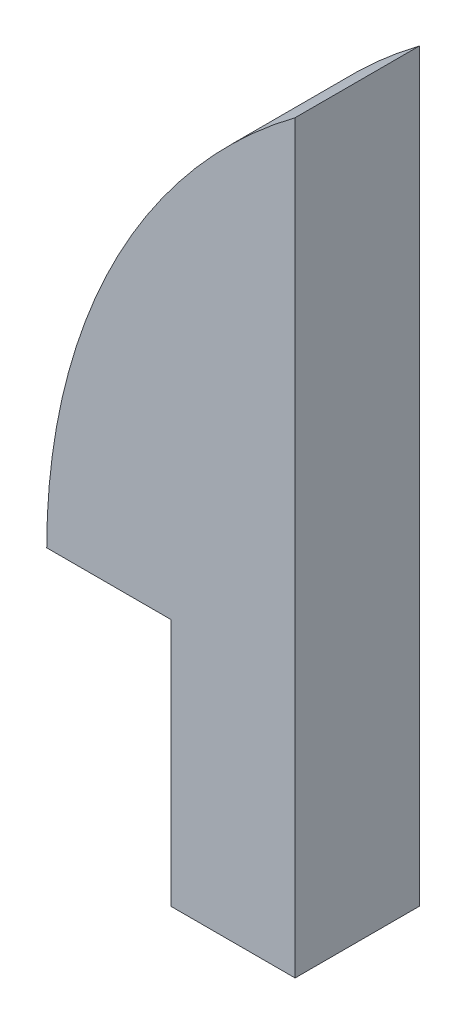
ISO-10303-21;
HEADER;
FILE_DESCRIPTION(('STEP AP214'),'2;1');
FILE_NAME('part.step','',(''),(''),'','','');
FILE_SCHEMA(('AUTOMOTIVE_DESIGN { 1 0 10303 214 1 1 1 1 }'));
ENDSEC;
DATA;
#1=APPLICATION_CONTEXT('core data for automotive mechanical design processes');
#2=APPLICATION_PROTOCOL_DEFINITION('international standard','automotive_design',2000,#1);
#3=PRODUCT_CONTEXT('',#1,'mechanical');
#4=PRODUCT('Part','Part','',(#3));
#5=PRODUCT_RELATED_PRODUCT_CATEGORY('part','',(#4));
#6=PRODUCT_DEFINITION_FORMATION('','',#4);
#7=PRODUCT_DEFINITION_CONTEXT('part definition',#1,'design');
#8=PRODUCT_DEFINITION('design','',#6,#7);
#9=PRODUCT_DEFINITION_SHAPE('','',#8);
#10=(LENGTH_UNIT() NAMED_UNIT(*) SI_UNIT(.MILLI.,.METRE.));
#11=(NAMED_UNIT(*) PLANE_ANGLE_UNIT() SI_UNIT($,.RADIAN.));
#12=(NAMED_UNIT(*) SI_UNIT($,.STERADIAN.) SOLID_ANGLE_UNIT());
#13=UNCERTAINTY_MEASURE_WITH_UNIT(LENGTH_MEASURE(1.E-05),#10,'distance_accuracy_value','');
#14=(GEOMETRIC_REPRESENTATION_CONTEXT(3) GLOBAL_UNCERTAINTY_ASSIGNED_CONTEXT((#13)) GLOBAL_UNIT_ASSIGNED_CONTEXT((#10,
#11,#12)) REPRESENTATION_CONTEXT('',''));
#15=CARTESIAN_POINT('',(0.,0.,0.));
#16=DIRECTION('',(0.,0.,1.));
#17=DIRECTION('',(1.,0.,0.));
#18=AXIS2_PLACEMENT_3D('',#15,#16,#17);
#19=CARTESIAN_POINT('',(31.75,12.7,6.35));
#20=DIRECTION('',(0.,0.,-1.));
#21=DIRECTION('',(-1.,0.,0.));
#22=AXIS2_PLACEMENT_3D('',#19,#20,#21);
#23=CYLINDRICAL_SURFACE('',#22,31.75);
#24=CARTESIAN_POINT('',(31.75,12.7,0.));
#25=DIRECTION('',(0.,0.,1.));
#26=DIRECTION('',(1.,0.,0.));
#27=AXIS2_PLACEMENT_3D('',#24,#25,#26);
#28=CIRCLE('',#27,31.75);
#29=CARTESIAN_POINT('',(0.,12.7,0.));
#30=VERTEX_POINT('',#29);
#31=CARTESIAN_POINT('',(12.7,38.1,0.));
#32=VERTEX_POINT('',#31);
#33=EDGE_CURVE('E108',#30,#32,#28,.F.);
#34=ORIENTED_EDGE('',*,*,#33,.F.);
#35=DIRECTION('',(0.,0.,-1.));
#36=VECTOR('',#35,1.);
#37=CARTESIAN_POINT('',(0.,12.7,6.35));
#38=LINE('',#37,#36);
#39=CARTESIAN_POINT('',(0.,12.7,6.35));
#40=VERTEX_POINT('',#39);
#41=EDGE_CURVE('E11',#40,#30,#38,.T.);
#42=ORIENTED_EDGE('',*,*,#41,.F.);
#43=CARTESIAN_POINT('',(31.75,12.7,6.35));
#44=DIRECTION('',(0.,0.,1.));
#45=DIRECTION('',(1.,0.,0.));
#46=AXIS2_PLACEMENT_3D('',#43,#44,#45);
#47=CIRCLE('',#46,31.75);
#48=CARTESIAN_POINT('',(12.7,38.1,6.35));
#49=VERTEX_POINT('',#48);
#50=EDGE_CURVE('E117',#40,#49,#47,.F.);
#51=ORIENTED_EDGE('',*,*,#50,.T.);
#52=DIRECTION('',(0.,0.,-1.));
#53=VECTOR('',#52,1.);
#54=CARTESIAN_POINT('',(12.7,38.1,6.35));
#55=LINE('',#54,#53);
#56=EDGE_CURVE('E77',#49,#32,#55,.T.);
#57=ORIENTED_EDGE('',*,*,#56,.T.);
#58=EDGE_LOOP('',(#34,#42,#51,#57));
#59=FACE_BOUND('',#58,.T.);
#60=ADVANCED_FACE('F35',(#59),#23,.T.);
#61=CARTESIAN_POINT('',(0.,12.7,6.35));
#62=DIRECTION('',(0.,1.,0.));
#63=DIRECTION('',(-1.,0.,0.));
#64=AXIS2_PLACEMENT_3D('',#61,#62,#63);
#65=PLANE('',#64);
#66=DIRECTION('',(1.,0.,0.));
#67=VECTOR('',#66,1.);
#68=CARTESIAN_POINT('',(0.,12.7,0.));
#69=LINE('',#68,#67);
#70=CARTESIAN_POINT('',(6.35,12.7,0.));
#71=VERTEX_POINT('',#70);
#72=EDGE_CURVE('E111',#30,#71,#69,.T.);
#73=ORIENTED_EDGE('',*,*,#72,.T.);
#74=DIRECTION('',(0.,0.,-1.));
#75=VECTOR('',#74,1.);
#76=CARTESIAN_POINT('',(6.35,12.7,6.35));
#77=LINE('',#76,#75);
#78=CARTESIAN_POINT('',(6.35,12.7,6.35));
#79=VERTEX_POINT('',#78);
#80=EDGE_CURVE('E43',#79,#71,#77,.T.);
#81=ORIENTED_EDGE('',*,*,#80,.F.);
#82=DIRECTION('',(1.,0.,0.));
#83=VECTOR('',#82,1.);
#84=CARTESIAN_POINT('',(0.,12.7,6.35));
#85=LINE('',#84,#83);
#86=EDGE_CURVE('E92',#40,#79,#85,.T.);
#87=ORIENTED_EDGE('',*,*,#86,.F.);
#88=ORIENTED_EDGE('',*,*,#41,.T.);
#89=EDGE_LOOP('',(#73,#81,#87,#88));
#90=FACE_BOUND('',#89,.T.);
#91=ADVANCED_FACE('F128',(#90),#65,.F.);
#92=CARTESIAN_POINT('',(6.35,0.,6.35));
#93=DIRECTION('',(1.,0.,0.));
#94=DIRECTION('',(0.,0.,-1.));
#95=AXIS2_PLACEMENT_3D('',#92,#93,#94);
#96=PLANE('',#95);
#97=DIRECTION('',(0.,-1.,0.));
#98=VECTOR('',#97,1.);
#99=CARTESIAN_POINT('',(6.35,0.,0.));
#100=LINE('',#99,#98);
#101=CARTESIAN_POINT('',(6.35,0.,0.));
#102=VERTEX_POINT('',#101);
#103=EDGE_CURVE('E100',#71,#102,#100,.T.);
#104=ORIENTED_EDGE('',*,*,#103,.T.);
#105=DIRECTION('',(0.,0.,-1.));
#106=VECTOR('',#105,1.);
#107=CARTESIAN_POINT('',(6.35,0.,6.35));
#108=LINE('',#107,#106);
#109=CARTESIAN_POINT('',(6.35,0.,6.35));
#110=VERTEX_POINT('',#109);
#111=EDGE_CURVE('E97',#110,#102,#108,.T.);
#112=ORIENTED_EDGE('',*,*,#111,.F.);
#113=DIRECTION('',(0.,-1.,0.));
#114=VECTOR('',#113,1.);
#115=CARTESIAN_POINT('',(6.35,0.,6.35));
#116=LINE('',#115,#114);
#117=EDGE_CURVE('E87',#79,#110,#116,.T.);
#118=ORIENTED_EDGE('',*,*,#117,.F.);
#119=ORIENTED_EDGE('',*,*,#80,.T.);
#120=EDGE_LOOP('',(#104,#112,#118,#119));
#121=FACE_BOUND('',#120,.T.);
#122=ADVANCED_FACE('F98',(#121),#96,.F.);
#123=CARTESIAN_POINT('',(0.,0.,6.35));
#124=DIRECTION('',(0.,1.,0.));
#125=DIRECTION('',(0.,0.,1.));
#126=AXIS2_PLACEMENT_3D('',#123,#124,#125);
#127=PLANE('',#126);
#128=DIRECTION('',(1.,0.,0.));
#129=VECTOR('',#128,1.);
#130=CARTESIAN_POINT('',(0.,0.,0.));
#131=LINE('',#130,#129);
#132=CARTESIAN_POINT('',(12.7,0.,0.));
#133=VERTEX_POINT('',#132);
#134=EDGE_CURVE('E70',#102,#133,#131,.T.);
#135=ORIENTED_EDGE('',*,*,#134,.T.);
#136=DIRECTION('',(0.,0.,-1.));
#137=VECTOR('',#136,1.);
#138=CARTESIAN_POINT('',(12.7,0.,6.35));
#139=LINE('',#138,#137);
#140=CARTESIAN_POINT('',(12.7,0.,6.35));
#141=VERTEX_POINT('',#140);
#142=EDGE_CURVE('E101',#141,#133,#139,.T.);
#143=ORIENTED_EDGE('',*,*,#142,.F.);
#144=DIRECTION('',(1.,0.,0.));
#145=VECTOR('',#144,1.);
#146=CARTESIAN_POINT('',(0.,0.,6.35));
#147=LINE('',#146,#145);
#148=EDGE_CURVE('E91',#110,#141,#147,.T.);
#149=ORIENTED_EDGE('',*,*,#148,.F.);
#150=ORIENTED_EDGE('',*,*,#111,.T.);
#151=EDGE_LOOP('',(#135,#143,#149,#150));
#152=FACE_BOUND('',#151,.T.);
#153=ADVANCED_FACE('F103',(#152),#127,.F.);
#154=CARTESIAN_POINT('',(12.7,0.,6.35));
#155=DIRECTION('',(-1.,0.,0.));
#156=DIRECTION('',(0.,0.,1.));
#157=AXIS2_PLACEMENT_3D('',#154,#155,#156);
#158=PLANE('',#157);
#159=DIRECTION('',(0.,1.,0.));
#160=VECTOR('',#159,1.);
#161=CARTESIAN_POINT('',(12.7,0.,0.));
#162=LINE('',#161,#160);
#163=EDGE_CURVE('E115',#133,#32,#162,.T.);
#164=ORIENTED_EDGE('',*,*,#163,.T.);
#165=ORIENTED_EDGE('',*,*,#56,.F.);
#166=DIRECTION('',(0.,1.,0.));
#167=VECTOR('',#166,1.);
#168=CARTESIAN_POINT('',(12.7,0.,6.35));
#169=LINE('',#168,#167);
#170=EDGE_CURVE('E51',#141,#49,#169,.T.);
#171=ORIENTED_EDGE('',*,*,#170,.F.);
#172=ORIENTED_EDGE('',*,*,#142,.T.);
#173=EDGE_LOOP('',(#164,#165,#171,#172));
#174=FACE_BOUND('',#173,.T.);
#175=ADVANCED_FACE('F125',(#174),#158,.F.);
#176=CARTESIAN_POINT('',(0.,0.,6.35));
#177=DIRECTION('',(0.,0.,1.));
#178=DIRECTION('',(1.,0.,0.));
#179=AXIS2_PLACEMENT_3D('',#176,#177,#178);
#180=PLANE('',#179);
#181=ORIENTED_EDGE('',*,*,#50,.F.);
#182=ORIENTED_EDGE('',*,*,#86,.T.);
#183=ORIENTED_EDGE('',*,*,#117,.T.);
#184=ORIENTED_EDGE('',*,*,#148,.T.);
#185=ORIENTED_EDGE('',*,*,#170,.T.);
#186=EDGE_LOOP('',(#181,#182,#183,#184,#185));
#187=FACE_BOUND('',#186,.T.);
#188=ADVANCED_FACE('F89',(#187),#180,.T.);
#189=CARTESIAN_POINT('',(0.,0.,0.));
#190=DIRECTION('',(0.,0.,1.));
#191=DIRECTION('',(1.,0.,0.));
#192=AXIS2_PLACEMENT_3D('',#189,#190,#191);
#193=PLANE('',#192);
#194=ORIENTED_EDGE('',*,*,#33,.T.);
#195=ORIENTED_EDGE('',*,*,#163,.F.);
#196=ORIENTED_EDGE('',*,*,#134,.F.);
#197=ORIENTED_EDGE('',*,*,#103,.F.);
#198=ORIENTED_EDGE('',*,*,#72,.F.);
#199=EDGE_LOOP('',(#194,#195,#196,#197,#198));
#200=FACE_BOUND('',#199,.T.);
#201=ADVANCED_FACE('F122',(#200),#193,.F.);
#202=CLOSED_SHELL('',(#60,#91,#122,#153,#175,#188,#201));
#203=MANIFOLD_SOLID_BREP('B2',#202);
#204=ADVANCED_BREP_SHAPE_REPRESENTATION('',(#18,#203),#14);
#205=SHAPE_DEFINITION_REPRESENTATION(#9,#204);
ENDSEC;
END-ISO-10303-21;
